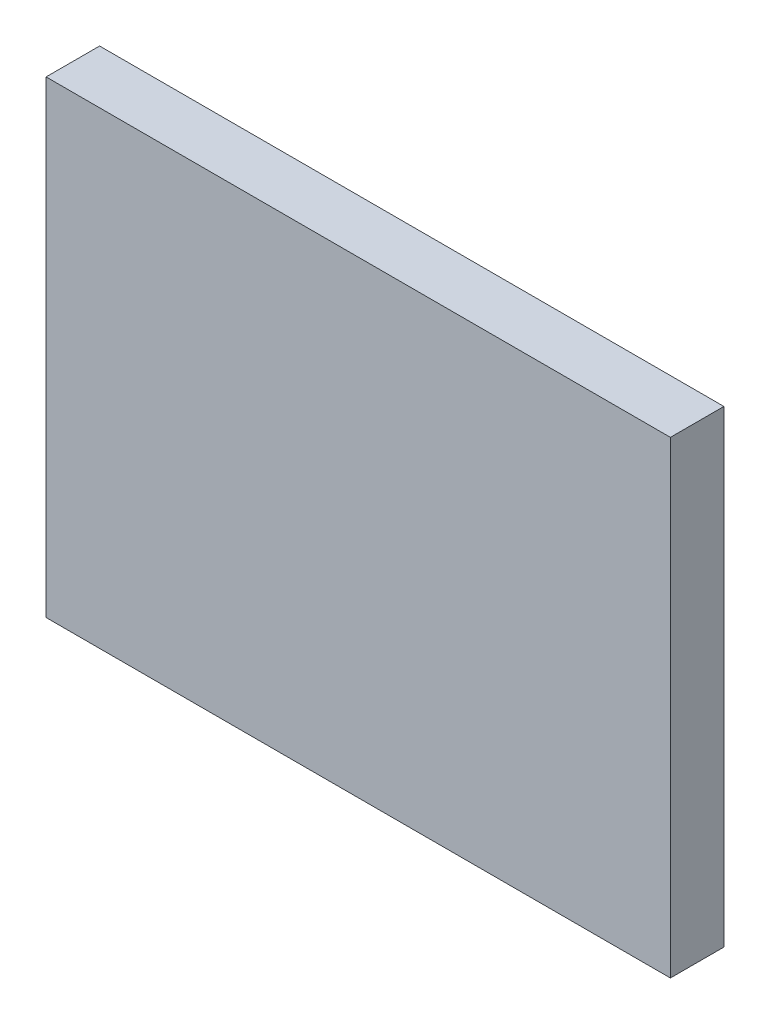
ISO-10303-21;
HEADER;
FILE_DESCRIPTION(('STEP AP214'),'2;1');
FILE_NAME('part.step','',(''),(''),'','','');
FILE_SCHEMA(('AUTOMOTIVE_DESIGN { 1 0 10303 214 1 1 1 1 }'));
ENDSEC;
DATA;
#1=APPLICATION_CONTEXT('core data for automotive mechanical design processes');
#2=APPLICATION_PROTOCOL_DEFINITION('international standard','automotive_design',2000,#1);
#3=PRODUCT_CONTEXT('',#1,'mechanical');
#4=PRODUCT('Part','Part','',(#3));
#5=PRODUCT_RELATED_PRODUCT_CATEGORY('part','',(#4));
#6=PRODUCT_DEFINITION_FORMATION('','',#4);
#7=PRODUCT_DEFINITION_CONTEXT('part definition',#1,'design');
#8=PRODUCT_DEFINITION('design','',#6,#7);
#9=PRODUCT_DEFINITION_SHAPE('','',#8);
#10=(LENGTH_UNIT() NAMED_UNIT(*) SI_UNIT(.MILLI.,.METRE.));
#11=(NAMED_UNIT(*) PLANE_ANGLE_UNIT() SI_UNIT($,.RADIAN.));
#12=(NAMED_UNIT(*) SI_UNIT($,.STERADIAN.) SOLID_ANGLE_UNIT());
#13=UNCERTAINTY_MEASURE_WITH_UNIT(LENGTH_MEASURE(1.E-05),#10,'distance_accuracy_value','');
#14=(GEOMETRIC_REPRESENTATION_CONTEXT(3) GLOBAL_UNCERTAINTY_ASSIGNED_CONTEXT((#13)) GLOBAL_UNIT_ASSIGNED_CONTEXT((#10,
#11,#12)) REPRESENTATION_CONTEXT('',''));
#15=CARTESIAN_POINT('',(0.,0.,0.));
#16=DIRECTION('',(0.,0.,1.));
#17=DIRECTION('',(1.,0.,0.));
#18=AXIS2_PLACEMENT_3D('',#15,#16,#17);
#19=CARTESIAN_POINT('',(3.763333333,8.505,0.76487));
#20=DIRECTION('',(0.,0.,-1.));
#21=DIRECTION('',(0.,1.,0.));
#22=AXIS2_PLACEMENT_3D('',#19,#20,#21);
#23=PLANE('',#22);
#24=DIRECTION('',(1.,0.,0.));
#25=VECTOR('',#24,1.);
#26=CARTESIAN_POINT('',(3.563333333,8.655,0.76487));
#27=LINE('',#26,#25);
#28=CARTESIAN_POINT('',(3.563333333,8.655,0.76487));
#29=VERTEX_POINT('',#28);
#30=CARTESIAN_POINT('',(3.963333333,8.655,0.76487));
#31=VERTEX_POINT('',#30);
#32=EDGE_CURVE('E55',#29,#31,#27,.T.);
#33=ORIENTED_EDGE('',*,*,#32,.T.);
#34=DIRECTION('',(0.,1.,0.));
#35=VECTOR('',#34,1.);
#36=CARTESIAN_POINT('',(3.963333333,8.655,0.76487));
#37=LINE('',#36,#35);
#38=CARTESIAN_POINT('',(3.963333333,8.355,0.76487));
#39=VERTEX_POINT('',#38);
#40=EDGE_CURVE('E57',#31,#39,#37,.F.);
#41=ORIENTED_EDGE('',*,*,#40,.T.);
#42=DIRECTION('',(1.,0.,0.));
#43=VECTOR('',#42,1.);
#44=CARTESIAN_POINT('',(3.963333333,8.355,0.76487));
#45=LINE('',#44,#43);
#46=CARTESIAN_POINT('',(3.563333333,8.355,0.76487));
#47=VERTEX_POINT('',#46);
#48=EDGE_CURVE('E20',#39,#47,#45,.F.);
#49=ORIENTED_EDGE('',*,*,#48,.T.);
#50=DIRECTION('',(0.,1.,0.));
#51=VECTOR('',#50,1.);
#52=CARTESIAN_POINT('',(3.563333333,8.355,0.76487));
#53=LINE('',#52,#51);
#54=EDGE_CURVE('E80',#47,#29,#53,.T.);
#55=ORIENTED_EDGE('',*,*,#54,.T.);
#56=EDGE_LOOP('',(#33,#41,#49,#55));
#57=FACE_BOUND('',#56,.T.);
#58=ADVANCED_FACE('F17',(#57),#23,.T.);
#59=CARTESIAN_POINT('',(3.963333333,8.355,0.76487));
#60=DIRECTION('',(0.,1.,0.));
#61=DIRECTION('',(0.,0.,1.));
#62=AXIS2_PLACEMENT_3D('',#59,#60,#61);
#63=PLANE('',#62);
#64=DIRECTION('',(0.,0.,-1.));
#65=VECTOR('',#64,1.);
#66=CARTESIAN_POINT('',(3.563333333,8.355,0.76487));
#67=LINE('',#66,#65);
#68=CARTESIAN_POINT('',(3.563333333,8.355,0.79916));
#69=VERTEX_POINT('',#68);
#70=EDGE_CURVE('E68',#69,#47,#67,.T.);
#71=ORIENTED_EDGE('',*,*,#70,.T.);
#72=ORIENTED_EDGE('',*,*,#48,.F.);
#73=DIRECTION('',(0.,0.,1.));
#74=VECTOR('',#73,1.);
#75=CARTESIAN_POINT('',(3.963333333,8.355,0.76487));
#76=LINE('',#75,#74);
#77=CARTESIAN_POINT('',(3.963333333,8.355,0.79916));
#78=VERTEX_POINT('',#77);
#79=EDGE_CURVE('E63',#39,#78,#76,.T.);
#80=ORIENTED_EDGE('',*,*,#79,.T.);
#81=DIRECTION('',(1.,0.,0.));
#82=VECTOR('',#81,1.);
#83=CARTESIAN_POINT('',(3.763333333,8.355,0.79916));
#84=LINE('',#83,#82);
#85=EDGE_CURVE('E83',#69,#78,#84,.T.);
#86=ORIENTED_EDGE('',*,*,#85,.F.);
#87=EDGE_LOOP('',(#71,#72,#80,#86));
#88=FACE_BOUND('',#87,.T.);
#89=ADVANCED_FACE('F65',(#88),#63,.F.);
#90=CARTESIAN_POINT('',(3.963333333,8.655,0.76487));
#91=DIRECTION('',(-1.,0.,0.));
#92=DIRECTION('',(0.,0.,1.));
#93=AXIS2_PLACEMENT_3D('',#90,#91,#92);
#94=PLANE('',#93);
#95=ORIENTED_EDGE('',*,*,#79,.F.);
#96=ORIENTED_EDGE('',*,*,#40,.F.);
#97=DIRECTION('',(0.,0.,-1.));
#98=VECTOR('',#97,1.);
#99=CARTESIAN_POINT('',(3.963333333,8.655,0.76487));
#100=LINE('',#99,#98);
#101=CARTESIAN_POINT('',(3.963333333,8.655,0.79916));
#102=VERTEX_POINT('',#101);
#103=EDGE_CURVE('E75',#31,#102,#100,.F.);
#104=ORIENTED_EDGE('',*,*,#103,.T.);
#105=DIRECTION('',(0.,-1.,0.));
#106=VECTOR('',#105,1.);
#107=CARTESIAN_POINT('',(3.963333333,8.505,0.79916));
#108=LINE('',#107,#106);
#109=EDGE_CURVE('E72',#78,#102,#108,.F.);
#110=ORIENTED_EDGE('',*,*,#109,.F.);
#111=EDGE_LOOP('',(#95,#96,#104,#110));
#112=FACE_BOUND('',#111,.T.);
#113=ADVANCED_FACE('F70',(#112),#94,.F.);
#114=CARTESIAN_POINT('',(3.563333333,8.655,0.76487));
#115=DIRECTION('',(0.,-1.,0.));
#116=DIRECTION('',(0.,0.,-1.));
#117=AXIS2_PLACEMENT_3D('',#114,#115,#116);
#118=PLANE('',#117);
#119=ORIENTED_EDGE('',*,*,#103,.F.);
#120=ORIENTED_EDGE('',*,*,#32,.F.);
#121=DIRECTION('',(0.,0.,-1.));
#122=VECTOR('',#121,1.);
#123=CARTESIAN_POINT('',(3.563333333,8.655,0.76487));
#124=LINE('',#123,#122);
#125=CARTESIAN_POINT('',(3.563333333,8.655,0.79916));
#126=VERTEX_POINT('',#125);
#127=EDGE_CURVE('E35',#29,#126,#124,.F.);
#128=ORIENTED_EDGE('',*,*,#127,.T.);
#129=DIRECTION('',(1.,0.,0.));
#130=VECTOR('',#129,1.);
#131=CARTESIAN_POINT('',(3.763333333,8.655,0.79916));
#132=LINE('',#131,#130);
#133=EDGE_CURVE('E26',#102,#126,#132,.F.);
#134=ORIENTED_EDGE('',*,*,#133,.F.);
#135=EDGE_LOOP('',(#119,#120,#128,#134));
#136=FACE_BOUND('',#135,.T.);
#137=ADVANCED_FACE('F89',(#136),#118,.F.);
#138=CARTESIAN_POINT('',(3.563333333,8.355,0.76487));
#139=DIRECTION('',(1.,0.,0.));
#140=DIRECTION('',(0.,0.,-1.));
#141=AXIS2_PLACEMENT_3D('',#138,#139,#140);
#142=PLANE('',#141);
#143=ORIENTED_EDGE('',*,*,#127,.F.);
#144=ORIENTED_EDGE('',*,*,#54,.F.);
#145=ORIENTED_EDGE('',*,*,#70,.F.);
#146=DIRECTION('',(0.,-1.,0.));
#147=VECTOR('',#146,1.);
#148=CARTESIAN_POINT('',(3.563333333,8.505,0.79916));
#149=LINE('',#148,#147);
#150=EDGE_CURVE('E11',#126,#69,#149,.T.);
#151=ORIENTED_EDGE('',*,*,#150,.F.);
#152=EDGE_LOOP('',(#143,#144,#145,#151));
#153=FACE_BOUND('',#152,.T.);
#154=ADVANCED_FACE('F91',(#153),#142,.F.);
#155=CARTESIAN_POINT('',(3.763333333,8.505,0.79916));
#156=DIRECTION('',(0.,0.,1.));
#157=DIRECTION('',(0.,-1.,0.));
#158=AXIS2_PLACEMENT_3D('',#155,#156,#157);
#159=PLANE('',#158);
#160=ORIENTED_EDGE('',*,*,#133,.T.);
#161=ORIENTED_EDGE('',*,*,#150,.T.);
#162=ORIENTED_EDGE('',*,*,#85,.T.);
#163=ORIENTED_EDGE('',*,*,#109,.T.);
#164=EDGE_LOOP('',(#160,#161,#162,#163));
#165=FACE_BOUND('',#164,.T.);
#166=ADVANCED_FACE('F88',(#165),#159,.T.);
#167=CLOSED_SHELL('',(#58,#89,#113,#137,#154,#166));
#168=MANIFOLD_SOLID_BREP('B1',#167);
#169=ADVANCED_BREP_SHAPE_REPRESENTATION('',(#18,#168),#14);
#170=SHAPE_DEFINITION_REPRESENTATION(#9,#169);
ENDSEC;
END-ISO-10303-21;
